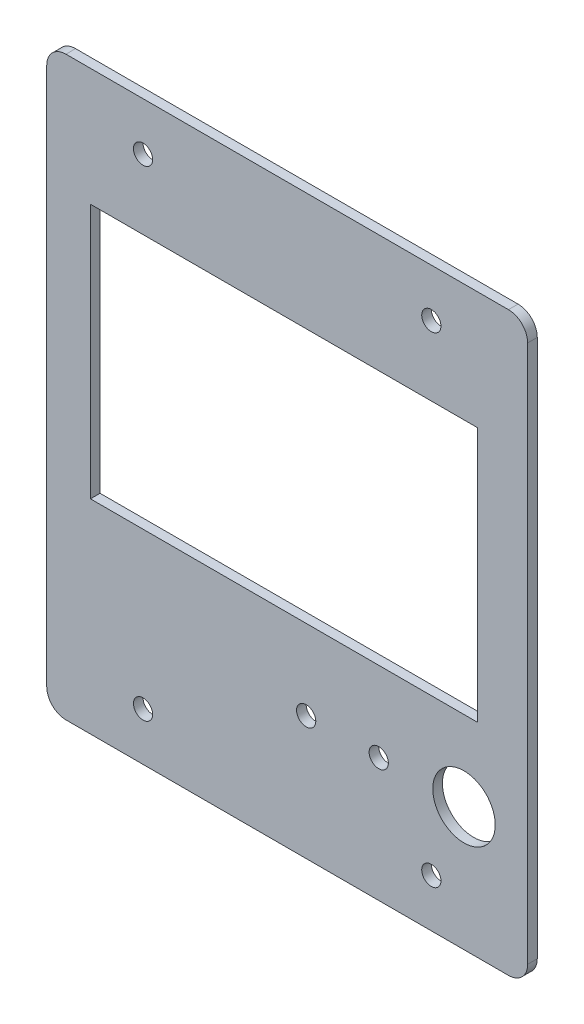
ISO-10303-21;
HEADER;
FILE_DESCRIPTION(('STEP AP214'),'2;1');
FILE_NAME('part.step','',(''),(''),'','','');
FILE_SCHEMA(('AUTOMOTIVE_DESIGN { 1 0 10303 214 1 1 1 1 }'));
ENDSEC;
DATA;
#1=APPLICATION_CONTEXT('core data for automotive mechanical design processes');
#2=APPLICATION_PROTOCOL_DEFINITION('international standard','automotive_design',2000,#1);
#3=PRODUCT_CONTEXT('',#1,'mechanical');
#4=PRODUCT('Part','Part','',(#3));
#5=PRODUCT_RELATED_PRODUCT_CATEGORY('part','',(#4));
#6=PRODUCT_DEFINITION_FORMATION('','',#4);
#7=PRODUCT_DEFINITION_CONTEXT('part definition',#1,'design');
#8=PRODUCT_DEFINITION('design','',#6,#7);
#9=PRODUCT_DEFINITION_SHAPE('','',#8);
#10=(LENGTH_UNIT() NAMED_UNIT(*) SI_UNIT(.MILLI.,.METRE.));
#11=(NAMED_UNIT(*) PLANE_ANGLE_UNIT() SI_UNIT($,.RADIAN.));
#12=(NAMED_UNIT(*) SI_UNIT($,.STERADIAN.) SOLID_ANGLE_UNIT());
#13=UNCERTAINTY_MEASURE_WITH_UNIT(LENGTH_MEASURE(1.E-05),#10,'distance_accuracy_value','');
#14=(GEOMETRIC_REPRESENTATION_CONTEXT(3) GLOBAL_UNCERTAINTY_ASSIGNED_CONTEXT((#13)) GLOBAL_UNIT_ASSIGNED_CONTEXT((#10,
#11,#12)) REPRESENTATION_CONTEXT('',''));
#15=CARTESIAN_POINT('',(0.,0.,0.));
#16=DIRECTION('',(0.,0.,1.));
#17=DIRECTION('',(1.,0.,0.));
#18=AXIS2_PLACEMENT_3D('',#15,#16,#17);
#19=CARTESIAN_POINT('',(46.05,56.,2.));
#20=DIRECTION('',(0.,0.,-1.));
#21=DIRECTION('',(-1.,0.,0.));
#22=AXIS2_PLACEMENT_3D('',#19,#20,#21);
#23=PLANE('',#22);
#24=CARTESIAN_POINT('',(19.05,-34.25,2.));
#25=DIRECTION('',(0.,0.,1.));
#26=DIRECTION('',(1.,0.,0.));
#27=AXIS2_PLACEMENT_3D('',#24,#25,#26);
#28=CIRCLE('',#27,2.);
#29=CARTESIAN_POINT('',(21.05,-34.25,2.));
#30=VERTEX_POINT('',#29);
#31=EDGE_CURVE('E362',#30,#30,#28,.T.);
#32=ORIENTED_EDGE('',*,*,#31,.F.);
#33=EDGE_LOOP('',(#32));
#34=FACE_BOUND('',#33,.T.);
#35=DIRECTION('',(0.,-1.,0.));
#36=VECTOR('',#35,1.);
#37=CARTESIAN_POINT('',(-40.95,35.5,2.));
#38=LINE('',#37,#36);
#39=CARTESIAN_POINT('',(-40.95,35.5,2.));
#40=VERTEX_POINT('',#39);
#41=CARTESIAN_POINT('',(-40.95,-17.6,2.));
#42=VERTEX_POINT('',#41);
#43=EDGE_CURVE('E122',#40,#42,#38,.T.);
#44=ORIENTED_EDGE('',*,*,#43,.F.);
#45=DIRECTION('',(-1.,0.,0.));
#46=VECTOR('',#45,1.);
#47=CARTESIAN_POINT('',(-40.95,35.5,2.));
#48=LINE('',#47,#46);
#49=CARTESIAN_POINT('',(39.65,35.5,2.));
#50=VERTEX_POINT('',#49);
#51=EDGE_CURVE('E145',#50,#40,#48,.T.);
#52=ORIENTED_EDGE('',*,*,#51,.F.);
#53=DIRECTION('',(0.,1.,0.));
#54=VECTOR('',#53,1.);
#55=CARTESIAN_POINT('',(39.65,35.5,2.));
#56=LINE('',#55,#54);
#57=CARTESIAN_POINT('',(39.65,-17.6,2.));
#58=VERTEX_POINT('',#57);
#59=EDGE_CURVE('E143',#58,#50,#56,.T.);
#60=ORIENTED_EDGE('',*,*,#59,.F.);
#61=DIRECTION('',(1.,0.,0.));
#62=VECTOR('',#61,1.);
#63=CARTESIAN_POINT('',(-40.95,-17.6,2.));
#64=LINE('',#63,#62);
#65=EDGE_CURVE('E130',#42,#58,#64,.T.);
#66=ORIENTED_EDGE('',*,*,#65,.F.);
#67=EDGE_LOOP('',(#44,#52,#60,#66));
#68=FACE_BOUND('',#67,.T.);
#69=CARTESIAN_POINT('',(30.,-50.,2.));
#70=DIRECTION('',(0.,0.,1.));
#71=DIRECTION('',(1.,0.,0.));
#72=AXIS2_PLACEMENT_3D('',#69,#70,#71);
#73=CIRCLE('',#72,2.);
#74=CARTESIAN_POINT('',(32.,-50.,2.));
#75=VERTEX_POINT('',#74);
#76=EDGE_CURVE('E167',#75,#75,#73,.T.);
#77=ORIENTED_EDGE('',*,*,#76,.F.);
#78=EDGE_LOOP('',(#77));
#79=FACE_BOUND('',#78,.T.);
#80=CARTESIAN_POINT('',(-30.,50.,2.));
#81=DIRECTION('',(0.,0.,1.));
#82=DIRECTION('',(1.,0.,0.));
#83=AXIS2_PLACEMENT_3D('',#80,#81,#82);
#84=CIRCLE('',#83,2.);
#85=CARTESIAN_POINT('',(-28.,50.,2.));
#86=VERTEX_POINT('',#85);
#87=EDGE_CURVE('E179',#86,#86,#84,.T.);
#88=ORIENTED_EDGE('',*,*,#87,.F.);
#89=EDGE_LOOP('',(#88));
#90=FACE_BOUND('',#89,.T.);
#91=CARTESIAN_POINT('',(46.05,56.,2.));
#92=DIRECTION('',(0.,0.,1.));
#93=DIRECTION('',(-1.,0.,0.));
#94=AXIS2_PLACEMENT_3D('',#91,#92,#93);
#95=CIRCLE('',#94,4.00000000000001);
#96=CARTESIAN_POINT('',(50.05,56.,2.));
#97=VERTEX_POINT('',#96);
#98=CARTESIAN_POINT('',(46.05,60.,2.));
#99=VERTEX_POINT('',#98);
#100=EDGE_CURVE('E185',#97,#99,#95,.T.);
#101=ORIENTED_EDGE('',*,*,#100,.T.);
#102=DIRECTION('',(-1.,0.,0.));
#103=VECTOR('',#102,1.);
#104=CARTESIAN_POINT('',(-46.05,60.,2.));
#105=LINE('',#104,#103);
#106=CARTESIAN_POINT('',(-46.05,60.,2.));
#107=VERTEX_POINT('',#106);
#108=EDGE_CURVE('E188',#99,#107,#105,.T.);
#109=ORIENTED_EDGE('',*,*,#108,.T.);
#110=CARTESIAN_POINT('',(-46.05,56.,2.));
#111=DIRECTION('',(0.,0.,1.));
#112=DIRECTION('',(1.,0.,0.));
#113=AXIS2_PLACEMENT_3D('',#110,#111,#112);
#114=CIRCLE('',#113,4.);
#115=CARTESIAN_POINT('',(-50.05,56.,2.));
#116=VERTEX_POINT('',#115);
#117=EDGE_CURVE('E191',#107,#116,#114,.T.);
#118=ORIENTED_EDGE('',*,*,#117,.T.);
#119=DIRECTION('',(0.,-1.,0.));
#120=VECTOR('',#119,1.);
#121=CARTESIAN_POINT('',(-50.05,56.,2.));
#122=LINE('',#121,#120);
#123=CARTESIAN_POINT('',(-50.05,-56.,2.));
#124=VERTEX_POINT('',#123);
#125=EDGE_CURVE('E193',#116,#124,#122,.T.);
#126=ORIENTED_EDGE('',*,*,#125,.T.);
#127=CARTESIAN_POINT('',(-46.05,-56.,2.));
#128=DIRECTION('',(0.,0.,1.));
#129=DIRECTION('',(1.,0.,0.));
#130=AXIS2_PLACEMENT_3D('',#127,#128,#129);
#131=CIRCLE('',#130,4.);
#132=CARTESIAN_POINT('',(-46.05,-60.,2.));
#133=VERTEX_POINT('',#132);
#134=EDGE_CURVE('E195',#124,#133,#131,.T.);
#135=ORIENTED_EDGE('',*,*,#134,.T.);
#136=DIRECTION('',(1.,0.,0.));
#137=VECTOR('',#136,1.);
#138=CARTESIAN_POINT('',(-46.05,-60.,2.));
#139=LINE('',#138,#137);
#140=CARTESIAN_POINT('',(46.05,-60.,2.));
#141=VERTEX_POINT('',#140);
#142=EDGE_CURVE('E197',#133,#141,#139,.T.);
#143=ORIENTED_EDGE('',*,*,#142,.T.);
#144=CARTESIAN_POINT('',(46.05,-56.,2.));
#145=DIRECTION('',(0.,0.,1.));
#146=DIRECTION('',(1.,0.,0.));
#147=AXIS2_PLACEMENT_3D('',#144,#145,#146);
#148=CIRCLE('',#147,4.);
#149=CARTESIAN_POINT('',(50.05,-56.,2.));
#150=VERTEX_POINT('',#149);
#151=EDGE_CURVE('E199',#141,#150,#148,.T.);
#152=ORIENTED_EDGE('',*,*,#151,.T.);
#153=DIRECTION('',(0.,1.,0.));
#154=VECTOR('',#153,1.);
#155=CARTESIAN_POINT('',(50.05,56.,2.));
#156=LINE('',#155,#154);
#157=EDGE_CURVE('E201',#150,#97,#156,.T.);
#158=ORIENTED_EDGE('',*,*,#157,.T.);
#159=EDGE_LOOP('',(#101,#109,#118,#126,#135,#143,#152,#158));
#160=FACE_BOUND('',#159,.T.);
#161=CARTESIAN_POINT('',(-30.,-50.,2.));
#162=DIRECTION('',(0.,0.,1.));
#163=DIRECTION('',(1.,0.,0.));
#164=AXIS2_PLACEMENT_3D('',#161,#162,#163);
#165=CIRCLE('',#164,2.);
#166=CARTESIAN_POINT('',(-28.,-50.,2.));
#167=VERTEX_POINT('',#166);
#168=EDGE_CURVE('E173',#167,#167,#165,.T.);
#169=ORIENTED_EDGE('',*,*,#168,.F.);
#170=EDGE_LOOP('',(#169));
#171=FACE_BOUND('',#170,.T.);
#172=CARTESIAN_POINT('',(30.,50.,2.));
#173=DIRECTION('',(0.,0.,1.));
#174=DIRECTION('',(1.,0.,0.));
#175=AXIS2_PLACEMENT_3D('',#172,#173,#174);
#176=CIRCLE('',#175,2.);
#177=CARTESIAN_POINT('',(32.,50.,2.));
#178=VERTEX_POINT('',#177);
#179=EDGE_CURVE('E161',#178,#178,#176,.T.);
#180=ORIENTED_EDGE('',*,*,#179,.F.);
#181=EDGE_LOOP('',(#180));
#182=FACE_BOUND('',#181,.T.);
#183=CARTESIAN_POINT('',(36.8,-34.25,2.));
#184=DIRECTION('',(0.,0.,1.));
#185=DIRECTION('',(1.,0.,0.));
#186=AXIS2_PLACEMENT_3D('',#183,#184,#185);
#187=CIRCLE('',#186,6.5);
#188=CARTESIAN_POINT('',(43.3,-34.25,2.));
#189=VERTEX_POINT('',#188);
#190=EDGE_CURVE('E151',#189,#189,#187,.T.);
#191=ORIENTED_EDGE('',*,*,#190,.F.);
#192=EDGE_LOOP('',(#191));
#193=FACE_BOUND('',#192,.T.);
#194=CARTESIAN_POINT('',(3.95000000000001,-34.25,2.));
#195=DIRECTION('',(0.,0.,1.));
#196=DIRECTION('',(1.,0.,0.));
#197=AXIS2_PLACEMENT_3D('',#194,#195,#196);
#198=CIRCLE('',#197,2.);
#199=CARTESIAN_POINT('',(5.95000000000001,-34.25,2.));
#200=VERTEX_POINT('',#199);
#201=EDGE_CURVE('E353',#200,#200,#198,.T.);
#202=ORIENTED_EDGE('',*,*,#201,.F.);
#203=EDGE_LOOP('',(#202));
#204=FACE_BOUND('',#203,.T.);
#205=ADVANCED_FACE('F33',(#34,#68,#79,#90,#160,#171,#182,#193,#204),#23,.F.);
#206=CARTESIAN_POINT('',(46.05,56.,0.));
#207=DIRECTION('',(0.,0.,-1.));
#208=DIRECTION('',(-1.,0.,0.));
#209=AXIS2_PLACEMENT_3D('',#206,#207,#208);
#210=PLANE('',#209);
#211=CARTESIAN_POINT('',(19.05,-34.25,0.));
#212=DIRECTION('',(0.,0.,1.));
#213=DIRECTION('',(1.,0.,0.));
#214=AXIS2_PLACEMENT_3D('',#211,#212,#213);
#215=CIRCLE('',#214,2.);
#216=CARTESIAN_POINT('',(21.05,-34.25,0.));
#217=VERTEX_POINT('',#216);
#218=EDGE_CURVE('E359',#217,#217,#215,.T.);
#219=ORIENTED_EDGE('',*,*,#218,.T.);
#220=EDGE_LOOP('',(#219));
#221=FACE_BOUND('',#220,.T.);
#222=DIRECTION('',(-1.,0.,0.));
#223=VECTOR('',#222,1.);
#224=CARTESIAN_POINT('',(-40.95,35.5,0.));
#225=LINE('',#224,#223);
#226=CARTESIAN_POINT('',(39.65,35.5,0.));
#227=VERTEX_POINT('',#226);
#228=CARTESIAN_POINT('',(-40.95,35.5,0.));
#229=VERTEX_POINT('',#228);
#230=EDGE_CURVE('E131',#227,#229,#225,.T.);
#231=ORIENTED_EDGE('',*,*,#230,.T.);
#232=DIRECTION('',(0.,-1.,0.));
#233=VECTOR('',#232,1.);
#234=CARTESIAN_POINT('',(-40.95,35.5,0.));
#235=LINE('',#234,#233);
#236=CARTESIAN_POINT('',(-40.95,-17.6,0.));
#237=VERTEX_POINT('',#236);
#238=EDGE_CURVE('E56',#229,#237,#235,.T.);
#239=ORIENTED_EDGE('',*,*,#238,.T.);
#240=DIRECTION('',(1.,0.,0.));
#241=VECTOR('',#240,1.);
#242=CARTESIAN_POINT('',(-40.95,-17.6,0.));
#243=LINE('',#242,#241);
#244=CARTESIAN_POINT('',(39.65,-17.6,0.));
#245=VERTEX_POINT('',#244);
#246=EDGE_CURVE('E137',#237,#245,#243,.T.);
#247=ORIENTED_EDGE('',*,*,#246,.T.);
#248=DIRECTION('',(0.,1.,0.));
#249=VECTOR('',#248,1.);
#250=CARTESIAN_POINT('',(39.65,35.5,0.));
#251=LINE('',#250,#249);
#252=EDGE_CURVE('E153',#245,#227,#251,.T.);
#253=ORIENTED_EDGE('',*,*,#252,.T.);
#254=EDGE_LOOP('',(#231,#239,#247,#253));
#255=FACE_BOUND('',#254,.T.);
#256=CARTESIAN_POINT('',(30.,-50.,0.));
#257=DIRECTION('',(0.,0.,1.));
#258=DIRECTION('',(1.,0.,0.));
#259=AXIS2_PLACEMENT_3D('',#256,#257,#258);
#260=CIRCLE('',#259,2.);
#261=CARTESIAN_POINT('',(32.,-50.,0.));
#262=VERTEX_POINT('',#261);
#263=EDGE_CURVE('E164',#262,#262,#260,.T.);
#264=ORIENTED_EDGE('',*,*,#263,.T.);
#265=EDGE_LOOP('',(#264));
#266=FACE_BOUND('',#265,.T.);
#267=CARTESIAN_POINT('',(-30.,50.,0.));
#268=DIRECTION('',(0.,0.,1.));
#269=DIRECTION('',(1.,0.,0.));
#270=AXIS2_PLACEMENT_3D('',#267,#268,#269);
#271=CIRCLE('',#270,2.);
#272=CARTESIAN_POINT('',(-28.,50.,0.));
#273=VERTEX_POINT('',#272);
#274=EDGE_CURVE('E176',#273,#273,#271,.T.);
#275=ORIENTED_EDGE('',*,*,#274,.T.);
#276=EDGE_LOOP('',(#275));
#277=FACE_BOUND('',#276,.T.);
#278=CARTESIAN_POINT('',(46.05,56.,0.));
#279=DIRECTION('',(0.,0.,1.));
#280=DIRECTION('',(-1.,0.,0.));
#281=AXIS2_PLACEMENT_3D('',#278,#279,#280);
#282=CIRCLE('',#281,4.00000000000001);
#283=CARTESIAN_POINT('',(50.05,56.,0.));
#284=VERTEX_POINT('',#283);
#285=CARTESIAN_POINT('',(46.05,60.,0.));
#286=VERTEX_POINT('',#285);
#287=EDGE_CURVE('E182',#284,#286,#282,.T.);
#288=ORIENTED_EDGE('',*,*,#287,.F.);
#289=DIRECTION('',(0.,1.,0.));
#290=VECTOR('',#289,1.);
#291=CARTESIAN_POINT('',(50.05,56.,0.));
#292=LINE('',#291,#290);
#293=CARTESIAN_POINT('',(50.05,-56.,0.));
#294=VERTEX_POINT('',#293);
#295=EDGE_CURVE('E189',#294,#284,#292,.T.);
#296=ORIENTED_EDGE('',*,*,#295,.F.);
#297=CARTESIAN_POINT('',(46.05,-56.,0.));
#298=DIRECTION('',(0.,0.,1.));
#299=DIRECTION('',(1.,0.,0.));
#300=AXIS2_PLACEMENT_3D('',#297,#298,#299);
#301=CIRCLE('',#300,4.);
#302=CARTESIAN_POINT('',(46.05,-60.,0.));
#303=VERTEX_POINT('',#302);
#304=EDGE_CURVE('E216',#303,#294,#301,.T.);
#305=ORIENTED_EDGE('',*,*,#304,.F.);
#306=DIRECTION('',(1.,0.,0.));
#307=VECTOR('',#306,1.);
#308=CARTESIAN_POINT('',(-46.05,-60.,0.));
#309=LINE('',#308,#307);
#310=CARTESIAN_POINT('',(-46.05,-60.,0.));
#311=VERTEX_POINT('',#310);
#312=EDGE_CURVE('E214',#311,#303,#309,.T.);
#313=ORIENTED_EDGE('',*,*,#312,.F.);
#314=CARTESIAN_POINT('',(-46.05,-56.,0.));
#315=DIRECTION('',(0.,0.,1.));
#316=DIRECTION('',(1.,0.,0.));
#317=AXIS2_PLACEMENT_3D('',#314,#315,#316);
#318=CIRCLE('',#317,4.);
#319=CARTESIAN_POINT('',(-50.05,-56.,0.));
#320=VERTEX_POINT('',#319);
#321=EDGE_CURVE('E212',#320,#311,#318,.T.);
#322=ORIENTED_EDGE('',*,*,#321,.F.);
#323=DIRECTION('',(0.,-1.,0.));
#324=VECTOR('',#323,1.);
#325=CARTESIAN_POINT('',(-50.05,56.,0.));
#326=LINE('',#325,#324);
#327=CARTESIAN_POINT('',(-50.05,56.,0.));
#328=VERTEX_POINT('',#327);
#329=EDGE_CURVE('E210',#328,#320,#326,.T.);
#330=ORIENTED_EDGE('',*,*,#329,.F.);
#331=CARTESIAN_POINT('',(-46.05,56.,0.));
#332=DIRECTION('',(0.,0.,1.));
#333=DIRECTION('',(1.,0.,0.));
#334=AXIS2_PLACEMENT_3D('',#331,#332,#333);
#335=CIRCLE('',#334,4.);
#336=CARTESIAN_POINT('',(-46.05,60.,0.));
#337=VERTEX_POINT('',#336);
#338=EDGE_CURVE('E208',#337,#328,#335,.T.);
#339=ORIENTED_EDGE('',*,*,#338,.F.);
#340=DIRECTION('',(-1.,0.,0.));
#341=VECTOR('',#340,1.);
#342=CARTESIAN_POINT('',(-46.05,60.,0.));
#343=LINE('',#342,#341);
#344=EDGE_CURVE('E206',#286,#337,#343,.T.);
#345=ORIENTED_EDGE('',*,*,#344,.F.);
#346=EDGE_LOOP('',(#288,#296,#305,#313,#322,#330,#339,#345));
#347=FACE_BOUND('',#346,.T.);
#348=CARTESIAN_POINT('',(-30.,-50.,0.));
#349=DIRECTION('',(0.,0.,1.));
#350=DIRECTION('',(1.,0.,0.));
#351=AXIS2_PLACEMENT_3D('',#348,#349,#350);
#352=CIRCLE('',#351,2.);
#353=CARTESIAN_POINT('',(-28.,-50.,0.));
#354=VERTEX_POINT('',#353);
#355=EDGE_CURVE('E170',#354,#354,#352,.T.);
#356=ORIENTED_EDGE('',*,*,#355,.T.);
#357=EDGE_LOOP('',(#356));
#358=FACE_BOUND('',#357,.T.);
#359=CARTESIAN_POINT('',(30.,50.,0.));
#360=DIRECTION('',(0.,0.,1.));
#361=DIRECTION('',(1.,0.,0.));
#362=AXIS2_PLACEMENT_3D('',#359,#360,#361);
#363=CIRCLE('',#362,2.);
#364=CARTESIAN_POINT('',(32.,50.,0.));
#365=VERTEX_POINT('',#364);
#366=EDGE_CURVE('E138',#365,#365,#363,.T.);
#367=ORIENTED_EDGE('',*,*,#366,.T.);
#368=EDGE_LOOP('',(#367));
#369=FACE_BOUND('',#368,.T.);
#370=CARTESIAN_POINT('',(36.8,-34.25,0.));
#371=DIRECTION('',(0.,0.,1.));
#372=DIRECTION('',(1.,0.,0.));
#373=AXIS2_PLACEMENT_3D('',#370,#371,#372);
#374=CIRCLE('',#373,6.5);
#375=CARTESIAN_POINT('',(43.3,-34.25,0.));
#376=VERTEX_POINT('',#375);
#377=EDGE_CURVE('E365',#376,#376,#374,.T.);
#378=ORIENTED_EDGE('',*,*,#377,.T.);
#379=EDGE_LOOP('',(#378));
#380=FACE_BOUND('',#379,.T.);
#381=CARTESIAN_POINT('',(3.95000000000001,-34.25,0.));
#382=DIRECTION('',(0.,0.,1.));
#383=DIRECTION('',(1.,0.,0.));
#384=AXIS2_PLACEMENT_3D('',#381,#382,#383);
#385=CIRCLE('',#384,2.);
#386=CARTESIAN_POINT('',(5.95000000000001,-34.25,0.));
#387=VERTEX_POINT('',#386);
#388=EDGE_CURVE('E356',#387,#387,#385,.T.);
#389=ORIENTED_EDGE('',*,*,#388,.T.);
#390=EDGE_LOOP('',(#389));
#391=FACE_BOUND('',#390,.T.);
#392=ADVANCED_FACE('F246',(#221,#255,#266,#277,#347,#358,#369,#380,#391),#210,.T.);
#393=CARTESIAN_POINT('',(46.05,56.,2.));
#394=DIRECTION('',(0.,0.,-1.));
#395=DIRECTION('',(-1.,0.,0.));
#396=AXIS2_PLACEMENT_3D('',#393,#394,#395);
#397=CYLINDRICAL_SURFACE('',#396,4.00000000000001);
#398=ORIENTED_EDGE('',*,*,#287,.T.);
#399=DIRECTION('',(0.,0.,-1.));
#400=VECTOR('',#399,1.);
#401=CARTESIAN_POINT('',(46.05,60.,2.));
#402=LINE('',#401,#400);
#403=EDGE_CURVE('E11',#99,#286,#402,.T.);
#404=ORIENTED_EDGE('',*,*,#403,.F.);
#405=ORIENTED_EDGE('',*,*,#100,.F.);
#406=DIRECTION('',(0.,0.,-1.));
#407=VECTOR('',#406,1.);
#408=CARTESIAN_POINT('',(50.05,56.,2.));
#409=LINE('',#408,#407);
#410=EDGE_CURVE('E203',#97,#284,#409,.T.);
#411=ORIENTED_EDGE('',*,*,#410,.T.);
#412=EDGE_LOOP('',(#398,#404,#405,#411));
#413=FACE_BOUND('',#412,.T.);
#414=ADVANCED_FACE('F35',(#413),#397,.T.);
#415=CARTESIAN_POINT('',(-46.05,60.,2.));
#416=DIRECTION('',(0.,-1.,0.));
#417=DIRECTION('',(1.,0.,0.));
#418=AXIS2_PLACEMENT_3D('',#415,#416,#417);
#419=PLANE('',#418);
#420=ORIENTED_EDGE('',*,*,#344,.T.);
#421=DIRECTION('',(0.,0.,-1.));
#422=VECTOR('',#421,1.);
#423=CARTESIAN_POINT('',(-46.05,60.,2.));
#424=LINE('',#423,#422);
#425=EDGE_CURVE('E41',#107,#337,#424,.T.);
#426=ORIENTED_EDGE('',*,*,#425,.F.);
#427=ORIENTED_EDGE('',*,*,#108,.F.);
#428=ORIENTED_EDGE('',*,*,#403,.T.);
#429=EDGE_LOOP('',(#420,#426,#427,#428));
#430=FACE_BOUND('',#429,.T.);
#431=ADVANCED_FACE('F264',(#430),#419,.F.);
#432=CARTESIAN_POINT('',(-46.05,56.,2.));
#433=DIRECTION('',(0.,0.,-1.));
#434=DIRECTION('',(-1.,0.,0.));
#435=AXIS2_PLACEMENT_3D('',#432,#433,#434);
#436=CYLINDRICAL_SURFACE('',#435,4.);
#437=ORIENTED_EDGE('',*,*,#338,.T.);
#438=DIRECTION('',(0.,0.,-1.));
#439=VECTOR('',#438,1.);
#440=CARTESIAN_POINT('',(-50.05,56.,2.));
#441=LINE('',#440,#439);
#442=EDGE_CURVE('E233',#116,#328,#441,.T.);
#443=ORIENTED_EDGE('',*,*,#442,.F.);
#444=ORIENTED_EDGE('',*,*,#117,.F.);
#445=ORIENTED_EDGE('',*,*,#425,.T.);
#446=EDGE_LOOP('',(#437,#443,#444,#445));
#447=FACE_BOUND('',#446,.T.);
#448=ADVANCED_FACE('F240',(#447),#436,.T.);
#449=CARTESIAN_POINT('',(-50.05,56.,2.));
#450=DIRECTION('',(1.,0.,0.));
#451=DIRECTION('',(0.,1.,0.));
#452=AXIS2_PLACEMENT_3D('',#449,#450,#451);
#453=PLANE('',#452);
#454=ORIENTED_EDGE('',*,*,#329,.T.);
#455=DIRECTION('',(0.,0.,-1.));
#456=VECTOR('',#455,1.);
#457=CARTESIAN_POINT('',(-50.05,-56.,2.));
#458=LINE('',#457,#456);
#459=EDGE_CURVE('E230',#124,#320,#458,.T.);
#460=ORIENTED_EDGE('',*,*,#459,.F.);
#461=ORIENTED_EDGE('',*,*,#125,.F.);
#462=ORIENTED_EDGE('',*,*,#442,.T.);
#463=EDGE_LOOP('',(#454,#460,#461,#462));
#464=FACE_BOUND('',#463,.T.);
#465=ADVANCED_FACE('F252',(#464),#453,.F.);
#466=CARTESIAN_POINT('',(-46.05,-56.,2.));
#467=DIRECTION('',(0.,0.,-1.));
#468=DIRECTION('',(-1.,0.,0.));
#469=AXIS2_PLACEMENT_3D('',#466,#467,#468);
#470=CYLINDRICAL_SURFACE('',#469,4.);
#471=ORIENTED_EDGE('',*,*,#321,.T.);
#472=DIRECTION('',(0.,0.,-1.));
#473=VECTOR('',#472,1.);
#474=CARTESIAN_POINT('',(-46.05,-60.,2.));
#475=LINE('',#474,#473);
#476=EDGE_CURVE('E227',#133,#311,#475,.T.);
#477=ORIENTED_EDGE('',*,*,#476,.F.);
#478=ORIENTED_EDGE('',*,*,#134,.F.);
#479=ORIENTED_EDGE('',*,*,#459,.T.);
#480=EDGE_LOOP('',(#471,#477,#478,#479));
#481=FACE_BOUND('',#480,.T.);
#482=ADVANCED_FACE('F256',(#481),#470,.T.);
#483=CARTESIAN_POINT('',(-46.05,-60.,2.));
#484=DIRECTION('',(0.,1.,0.));
#485=DIRECTION('',(-1.,0.,0.));
#486=AXIS2_PLACEMENT_3D('',#483,#484,#485);
#487=PLANE('',#486);
#488=ORIENTED_EDGE('',*,*,#312,.T.);
#489=DIRECTION('',(0.,0.,-1.));
#490=VECTOR('',#489,1.);
#491=CARTESIAN_POINT('',(46.05,-60.,2.));
#492=LINE('',#491,#490);
#493=EDGE_CURVE('E224',#141,#303,#492,.T.);
#494=ORIENTED_EDGE('',*,*,#493,.F.);
#495=ORIENTED_EDGE('',*,*,#142,.F.);
#496=ORIENTED_EDGE('',*,*,#476,.T.);
#497=EDGE_LOOP('',(#488,#494,#495,#496));
#498=FACE_BOUND('',#497,.T.);
#499=ADVANCED_FACE('F277',(#498),#487,.F.);
#500=CARTESIAN_POINT('',(46.05,-56.,2.));
#501=DIRECTION('',(0.,0.,-1.));
#502=DIRECTION('',(-1.,0.,0.));
#503=AXIS2_PLACEMENT_3D('',#500,#501,#502);
#504=CYLINDRICAL_SURFACE('',#503,4.);
#505=ORIENTED_EDGE('',*,*,#304,.T.);
#506=DIRECTION('',(0.,0.,-1.));
#507=VECTOR('',#506,1.);
#508=CARTESIAN_POINT('',(50.05,-56.,2.));
#509=LINE('',#508,#507);
#510=EDGE_CURVE('E221',#150,#294,#509,.T.);
#511=ORIENTED_EDGE('',*,*,#510,.F.);
#512=ORIENTED_EDGE('',*,*,#151,.F.);
#513=ORIENTED_EDGE('',*,*,#493,.T.);
#514=EDGE_LOOP('',(#505,#511,#512,#513));
#515=FACE_BOUND('',#514,.T.);
#516=ADVANCED_FACE('F275',(#515),#504,.T.);
#517=CARTESIAN_POINT('',(50.05,56.,2.));
#518=DIRECTION('',(-1.,0.,0.));
#519=DIRECTION('',(0.,-1.,0.));
#520=AXIS2_PLACEMENT_3D('',#517,#518,#519);
#521=PLANE('',#520);
#522=ORIENTED_EDGE('',*,*,#295,.T.);
#523=ORIENTED_EDGE('',*,*,#410,.F.);
#524=ORIENTED_EDGE('',*,*,#157,.F.);
#525=ORIENTED_EDGE('',*,*,#510,.T.);
#526=EDGE_LOOP('',(#522,#523,#524,#525));
#527=FACE_BOUND('',#526,.T.);
#528=ADVANCED_FACE('F270',(#527),#521,.F.);
#529=CARTESIAN_POINT('',(-30.,50.,2.));
#530=DIRECTION('',(0.,0.,-1.));
#531=DIRECTION('',(-1.,0.,0.));
#532=AXIS2_PLACEMENT_3D('',#529,#530,#531);
#533=CYLINDRICAL_SURFACE('',#532,2.);
#534=ORIENTED_EDGE('',*,*,#87,.T.);
#535=EDGE_LOOP('',(#534));
#536=FACE_BOUND('',#535,.T.);
#537=ORIENTED_EDGE('',*,*,#274,.F.);
#538=EDGE_LOOP('',(#537));
#539=FACE_BOUND('',#538,.T.);
#540=ADVANCED_FACE('F296',(#536,#539),#533,.F.);
#541=CARTESIAN_POINT('',(-30.,-50.,2.));
#542=DIRECTION('',(0.,0.,-1.));
#543=DIRECTION('',(-1.,0.,0.));
#544=AXIS2_PLACEMENT_3D('',#541,#542,#543);
#545=CYLINDRICAL_SURFACE('',#544,2.);
#546=ORIENTED_EDGE('',*,*,#168,.T.);
#547=EDGE_LOOP('',(#546));
#548=FACE_BOUND('',#547,.T.);
#549=ORIENTED_EDGE('',*,*,#355,.F.);
#550=EDGE_LOOP('',(#549));
#551=FACE_BOUND('',#550,.T.);
#552=ADVANCED_FACE('F303',(#548,#551),#545,.F.);
#553=CARTESIAN_POINT('',(30.,-50.,2.));
#554=DIRECTION('',(0.,0.,-1.));
#555=DIRECTION('',(-1.,0.,0.));
#556=AXIS2_PLACEMENT_3D('',#553,#554,#555);
#557=CYLINDRICAL_SURFACE('',#556,2.);
#558=ORIENTED_EDGE('',*,*,#76,.T.);
#559=EDGE_LOOP('',(#558));
#560=FACE_BOUND('',#559,.T.);
#561=ORIENTED_EDGE('',*,*,#263,.F.);
#562=EDGE_LOOP('',(#561));
#563=FACE_BOUND('',#562,.T.);
#564=ADVANCED_FACE('F308',(#560,#563),#557,.F.);
#565=CARTESIAN_POINT('',(30.,50.,2.));
#566=DIRECTION('',(0.,0.,-1.));
#567=DIRECTION('',(-1.,0.,0.));
#568=AXIS2_PLACEMENT_3D('',#565,#566,#567);
#569=CYLINDRICAL_SURFACE('',#568,2.);
#570=ORIENTED_EDGE('',*,*,#179,.T.);
#571=EDGE_LOOP('',(#570));
#572=FACE_BOUND('',#571,.T.);
#573=ORIENTED_EDGE('',*,*,#366,.F.);
#574=EDGE_LOOP('',(#573));
#575=FACE_BOUND('',#574,.T.);
#576=ADVANCED_FACE('F318',(#572,#575),#569,.F.);
#577=CARTESIAN_POINT('',(-40.95,35.5,2.));
#578=DIRECTION('',(1.,0.,0.));
#579=DIRECTION('',(0.,1.,0.));
#580=AXIS2_PLACEMENT_3D('',#577,#578,#579);
#581=PLANE('',#580);
#582=ORIENTED_EDGE('',*,*,#238,.F.);
#583=DIRECTION('',(0.,0.,-1.));
#584=VECTOR('',#583,1.);
#585=CARTESIAN_POINT('',(-40.95,35.5,2.));
#586=LINE('',#585,#584);
#587=EDGE_CURVE('E126',#40,#229,#586,.T.);
#588=ORIENTED_EDGE('',*,*,#587,.F.);
#589=ORIENTED_EDGE('',*,*,#43,.T.);
#590=DIRECTION('',(0.,0.,-1.));
#591=VECTOR('',#590,1.);
#592=CARTESIAN_POINT('',(-40.95,-17.6,2.));
#593=LINE('',#592,#591);
#594=EDGE_CURVE('E125',#42,#237,#593,.T.);
#595=ORIENTED_EDGE('',*,*,#594,.T.);
#596=EDGE_LOOP('',(#582,#588,#589,#595));
#597=FACE_BOUND('',#596,.T.);
#598=ADVANCED_FACE('F124',(#597),#581,.T.);
#599=CARTESIAN_POINT('',(-40.95,-17.6,2.));
#600=DIRECTION('',(0.,1.,0.));
#601=DIRECTION('',(0.,0.,1.));
#602=AXIS2_PLACEMENT_3D('',#599,#600,#601);
#603=PLANE('',#602);
#604=ORIENTED_EDGE('',*,*,#246,.F.);
#605=ORIENTED_EDGE('',*,*,#594,.F.);
#606=ORIENTED_EDGE('',*,*,#65,.T.);
#607=DIRECTION('',(0.,0.,-1.));
#608=VECTOR('',#607,1.);
#609=CARTESIAN_POINT('',(39.65,-17.6,2.));
#610=LINE('',#609,#608);
#611=EDGE_CURVE('E139',#58,#245,#610,.T.);
#612=ORIENTED_EDGE('',*,*,#611,.T.);
#613=EDGE_LOOP('',(#604,#605,#606,#612));
#614=FACE_BOUND('',#613,.T.);
#615=ADVANCED_FACE('F134',(#614),#603,.T.);
#616=CARTESIAN_POINT('',(39.65,35.5,2.));
#617=DIRECTION('',(-1.,0.,0.));
#618=DIRECTION('',(0.,-1.,0.));
#619=AXIS2_PLACEMENT_3D('',#616,#617,#618);
#620=PLANE('',#619);
#621=ORIENTED_EDGE('',*,*,#252,.F.);
#622=ORIENTED_EDGE('',*,*,#611,.F.);
#623=ORIENTED_EDGE('',*,*,#59,.T.);
#624=DIRECTION('',(0.,0.,-1.));
#625=VECTOR('',#624,1.);
#626=CARTESIAN_POINT('',(39.65,35.5,2.));
#627=LINE('',#626,#625);
#628=EDGE_CURVE('E48',#50,#227,#627,.T.);
#629=ORIENTED_EDGE('',*,*,#628,.T.);
#630=EDGE_LOOP('',(#621,#622,#623,#629));
#631=FACE_BOUND('',#630,.T.);
#632=ADVANCED_FACE('F330',(#631),#620,.T.);
#633=CARTESIAN_POINT('',(-40.95,35.5,2.));
#634=DIRECTION('',(0.,-1.,0.));
#635=DIRECTION('',(0.,0.,-1.));
#636=AXIS2_PLACEMENT_3D('',#633,#634,#635);
#637=PLANE('',#636);
#638=ORIENTED_EDGE('',*,*,#230,.F.);
#639=ORIENTED_EDGE('',*,*,#628,.F.);
#640=ORIENTED_EDGE('',*,*,#51,.T.);
#641=ORIENTED_EDGE('',*,*,#587,.T.);
#642=EDGE_LOOP('',(#638,#639,#640,#641));
#643=FACE_BOUND('',#642,.T.);
#644=ADVANCED_FACE('F333',(#643),#637,.T.);
#645=CARTESIAN_POINT('',(36.8,-34.25,2.));
#646=DIRECTION('',(0.,0.,-1.));
#647=DIRECTION('',(-1.,0.,0.));
#648=AXIS2_PLACEMENT_3D('',#645,#646,#647);
#649=CYLINDRICAL_SURFACE('',#648,6.5);
#650=ORIENTED_EDGE('',*,*,#190,.T.);
#651=EDGE_LOOP('',(#650));
#652=FACE_BOUND('',#651,.T.);
#653=ORIENTED_EDGE('',*,*,#377,.F.);
#654=EDGE_LOOP('',(#653));
#655=FACE_BOUND('',#654,.T.);
#656=ADVANCED_FACE('F337',(#652,#655),#649,.F.);
#657=CARTESIAN_POINT('',(19.05,-34.25,2.));
#658=DIRECTION('',(0.,0.,-1.));
#659=DIRECTION('',(-1.,0.,0.));
#660=AXIS2_PLACEMENT_3D('',#657,#658,#659);
#661=CYLINDRICAL_SURFACE('',#660,2.);
#662=ORIENTED_EDGE('',*,*,#31,.T.);
#663=EDGE_LOOP('',(#662));
#664=FACE_BOUND('',#663,.T.);
#665=ORIENTED_EDGE('',*,*,#218,.F.);
#666=EDGE_LOOP('',(#665));
#667=FACE_BOUND('',#666,.T.);
#668=ADVANCED_FACE('F340',(#664,#667),#661,.F.);
#669=CARTESIAN_POINT('',(3.95000000000001,-34.25,2.));
#670=DIRECTION('',(0.,0.,-1.));
#671=DIRECTION('',(-1.,0.,0.));
#672=AXIS2_PLACEMENT_3D('',#669,#670,#671);
#673=CYLINDRICAL_SURFACE('',#672,2.);
#674=ORIENTED_EDGE('',*,*,#201,.T.);
#675=EDGE_LOOP('',(#674));
#676=FACE_BOUND('',#675,.T.);
#677=ORIENTED_EDGE('',*,*,#388,.F.);
#678=EDGE_LOOP('',(#677));
#679=FACE_BOUND('',#678,.T.);
#680=ADVANCED_FACE('F344',(#676,#679),#673,.F.);
#681=CLOSED_SHELL('',(#205,#392,#414,#431,#448,#465,#482,#499,#516,#528,#540,#552,#564,#576,
#598,#615,#632,#644,#656,#668,#680));
#682=MANIFOLD_SOLID_BREP('B2',#681);
#683=ADVANCED_BREP_SHAPE_REPRESENTATION('',(#18,#682),#14);
#684=SHAPE_DEFINITION_REPRESENTATION(#9,#683);
ENDSEC;
END-ISO-10303-21;
